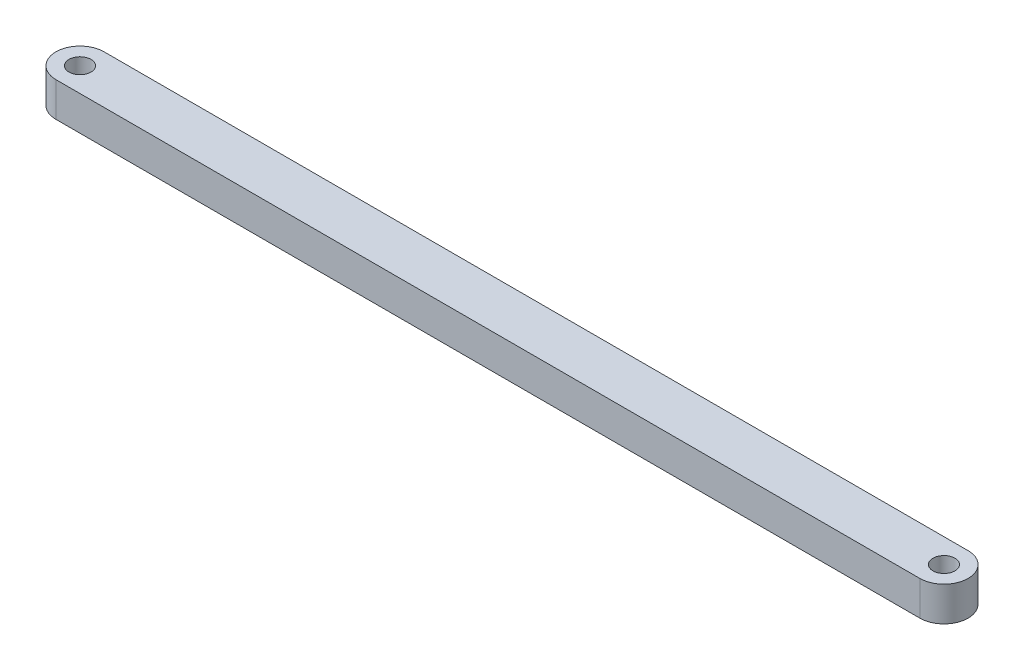
ISO-10303-21;
HEADER;
FILE_DESCRIPTION(('STEP AP214'),'2;1');
FILE_NAME('part.step','',(''),(''),'','','');
FILE_SCHEMA(('AUTOMOTIVE_DESIGN { 1 0 10303 214 1 1 1 1 }'));
ENDSEC;
DATA;
#1=APPLICATION_CONTEXT('core data for automotive mechanical design processes');
#2=APPLICATION_PROTOCOL_DEFINITION('international standard','automotive_design',2000,#1);
#3=PRODUCT_CONTEXT('',#1,'mechanical');
#4=PRODUCT('Part','Part','',(#3));
#5=PRODUCT_RELATED_PRODUCT_CATEGORY('part','',(#4));
#6=PRODUCT_DEFINITION_FORMATION('','',#4);
#7=PRODUCT_DEFINITION_CONTEXT('part definition',#1,'design');
#8=PRODUCT_DEFINITION('design','',#6,#7);
#9=PRODUCT_DEFINITION_SHAPE('','',#8);
#10=(LENGTH_UNIT() NAMED_UNIT(*) SI_UNIT(.MILLI.,.METRE.));
#11=(NAMED_UNIT(*) PLANE_ANGLE_UNIT() SI_UNIT($,.RADIAN.));
#12=(NAMED_UNIT(*) SI_UNIT($,.STERADIAN.) SOLID_ANGLE_UNIT());
#13=UNCERTAINTY_MEASURE_WITH_UNIT(LENGTH_MEASURE(1.E-05),#10,'distance_accuracy_value','');
#14=(GEOMETRIC_REPRESENTATION_CONTEXT(3) GLOBAL_UNCERTAINTY_ASSIGNED_CONTEXT((#13)) GLOBAL_UNIT_ASSIGNED_CONTEXT((#10,
#11,#12)) REPRESENTATION_CONTEXT('',''));
#15=CARTESIAN_POINT('',(0.,0.,0.));
#16=DIRECTION('',(0.,0.,1.));
#17=DIRECTION('',(1.,0.,0.));
#18=AXIS2_PLACEMENT_3D('',#15,#16,#17);
#19=CARTESIAN_POINT('',(0.,5.,0.));
#20=DIRECTION('',(0.,1.,0.));
#21=DIRECTION('',(0.,0.,1.));
#22=AXIS2_PLACEMENT_3D('',#19,#20,#21);
#23=PLANE('',#22);
#24=CARTESIAN_POINT('',(0.,5.,0.));
#25=DIRECTION('',(0.,1.,0.));
#26=DIRECTION('',(0.,0.,1.));
#27=AXIS2_PLACEMENT_3D('',#24,#25,#26);
#28=CIRCLE('',#27,1.6);
#29=CARTESIAN_POINT('',(0.,5.,1.6));
#30=VERTEX_POINT('',#29);
#31=EDGE_CURVE('E118',#30,#30,#28,.T.);
#32=ORIENTED_EDGE('',*,*,#31,.F.);
#33=EDGE_LOOP('',(#32));
#34=FACE_BOUND('',#33,.T.);
#35=CARTESIAN_POINT('',(0.,5.,0.));
#36=DIRECTION('',(0.,1.,0.));
#37=DIRECTION('',(0.,0.,1.));
#38=AXIS2_PLACEMENT_3D('',#35,#36,#37);
#39=CIRCLE('',#38,3.5);
#40=CARTESIAN_POINT('',(0.,5.,-3.5));
#41=VERTEX_POINT('',#40);
#42=CARTESIAN_POINT('',(0.,5.,3.5));
#43=VERTEX_POINT('',#42);
#44=EDGE_CURVE('E98',#41,#43,#39,.T.);
#45=ORIENTED_EDGE('',*,*,#44,.T.);
#46=DIRECTION('',(1.,0.,0.));
#47=VECTOR('',#46,1.);
#48=CARTESIAN_POINT('',(0.,5.,3.5));
#49=LINE('',#48,#47);
#50=CARTESIAN_POINT('',(125.5,5.,3.5));
#51=VERTEX_POINT('',#50);
#52=EDGE_CURVE('E93',#43,#51,#49,.T.);
#53=ORIENTED_EDGE('',*,*,#52,.T.);
#54=CARTESIAN_POINT('',(125.5,5.,0.));
#55=DIRECTION('',(0.,1.,0.));
#56=DIRECTION('',(0.,0.,1.));
#57=AXIS2_PLACEMENT_3D('',#54,#55,#56);
#58=CIRCLE('',#57,3.5);
#59=CARTESIAN_POINT('',(125.5,5.,-3.5));
#60=VERTEX_POINT('',#59);
#61=EDGE_CURVE('E96',#51,#60,#58,.T.);
#62=ORIENTED_EDGE('',*,*,#61,.T.);
#63=DIRECTION('',(-1.,0.,0.));
#64=VECTOR('',#63,1.);
#65=CARTESIAN_POINT('',(0.,5.,-3.5));
#66=LINE('',#65,#64);
#67=EDGE_CURVE('E63',#60,#41,#66,.T.);
#68=ORIENTED_EDGE('',*,*,#67,.T.);
#69=EDGE_LOOP('',(#45,#53,#62,#68));
#70=FACE_BOUND('',#69,.T.);
#71=CARTESIAN_POINT('',(125.5,5.,0.));
#72=DIRECTION('',(0.,1.,0.));
#73=DIRECTION('',(0.,0.,1.));
#74=AXIS2_PLACEMENT_3D('',#71,#72,#73);
#75=CIRCLE('',#74,1.59999999999999);
#76=CARTESIAN_POINT('',(125.5,5.,1.59999999999999));
#77=VERTEX_POINT('',#76);
#78=EDGE_CURVE('E140',#77,#77,#75,.T.);
#79=ORIENTED_EDGE('',*,*,#78,.F.);
#80=EDGE_LOOP('',(#79));
#81=FACE_BOUND('',#80,.T.);
#82=ADVANCED_FACE('F45',(#34,#70,#81),#23,.T.);
#83=CARTESIAN_POINT('',(0.,0.,0.));
#84=DIRECTION('',(0.,1.,0.));
#85=DIRECTION('',(0.,0.,1.));
#86=AXIS2_PLACEMENT_3D('',#83,#84,#85);
#87=PLANE('',#86);
#88=CARTESIAN_POINT('',(0.,0.,0.));
#89=DIRECTION('',(0.,1.,0.));
#90=DIRECTION('',(0.,0.,1.));
#91=AXIS2_PLACEMENT_3D('',#88,#89,#90);
#92=CIRCLE('',#91,3.5);
#93=CARTESIAN_POINT('',(0.,0.,-3.5));
#94=VERTEX_POINT('',#93);
#95=CARTESIAN_POINT('',(0.,0.,3.5));
#96=VERTEX_POINT('',#95);
#97=EDGE_CURVE('E114',#94,#96,#92,.T.);
#98=ORIENTED_EDGE('',*,*,#97,.F.);
#99=DIRECTION('',(-1.,0.,0.));
#100=VECTOR('',#99,1.);
#101=CARTESIAN_POINT('',(0.,0.,-3.5));
#102=LINE('',#101,#100);
#103=CARTESIAN_POINT('',(125.5,0.,-3.5));
#104=VERTEX_POINT('',#103);
#105=EDGE_CURVE('E86',#104,#94,#102,.T.);
#106=ORIENTED_EDGE('',*,*,#105,.F.);
#107=CARTESIAN_POINT('',(125.5,0.,0.));
#108=DIRECTION('',(0.,1.,0.));
#109=DIRECTION('',(0.,0.,1.));
#110=AXIS2_PLACEMENT_3D('',#107,#108,#109);
#111=CIRCLE('',#110,3.5);
#112=CARTESIAN_POINT('',(125.5,0.,3.5));
#113=VERTEX_POINT('',#112);
#114=EDGE_CURVE('E80',#113,#104,#111,.T.);
#115=ORIENTED_EDGE('',*,*,#114,.F.);
#116=DIRECTION('',(1.,0.,0.));
#117=VECTOR('',#116,1.);
#118=CARTESIAN_POINT('',(0.,0.,3.5));
#119=LINE('',#118,#117);
#120=EDGE_CURVE('E103',#96,#113,#119,.T.);
#121=ORIENTED_EDGE('',*,*,#120,.F.);
#122=EDGE_LOOP('',(#98,#106,#115,#121));
#123=FACE_BOUND('',#122,.T.);
#124=CARTESIAN_POINT('',(0.,0.,0.));
#125=DIRECTION('',(0.,1.,0.));
#126=DIRECTION('',(0.,0.,1.));
#127=AXIS2_PLACEMENT_3D('',#124,#125,#126);
#128=CIRCLE('',#127,1.6);
#129=CARTESIAN_POINT('',(0.,0.,1.6));
#130=VERTEX_POINT('',#129);
#131=EDGE_CURVE('E136',#130,#130,#128,.T.);
#132=ORIENTED_EDGE('',*,*,#131,.T.);
#133=EDGE_LOOP('',(#132));
#134=FACE_BOUND('',#133,.T.);
#135=CARTESIAN_POINT('',(125.5,0.,0.));
#136=DIRECTION('',(0.,1.,0.));
#137=DIRECTION('',(0.,0.,1.));
#138=AXIS2_PLACEMENT_3D('',#135,#136,#137);
#139=CIRCLE('',#138,1.59999999999999);
#140=CARTESIAN_POINT('',(125.5,0.,1.59999999999999));
#141=VERTEX_POINT('',#140);
#142=EDGE_CURVE('E144',#141,#141,#139,.T.);
#143=ORIENTED_EDGE('',*,*,#142,.T.);
#144=EDGE_LOOP('',(#143));
#145=FACE_BOUND('',#144,.T.);
#146=ADVANCED_FACE('F131',(#123,#134,#145),#87,.F.);
#147=CARTESIAN_POINT('',(0.,5.,0.));
#148=DIRECTION('',(0.,-1.,0.));
#149=DIRECTION('',(0.,0.,-1.));
#150=AXIS2_PLACEMENT_3D('',#147,#148,#149);
#151=CYLINDRICAL_SURFACE('',#150,3.5);
#152=ORIENTED_EDGE('',*,*,#97,.T.);
#153=DIRECTION('',(0.,-1.,0.));
#154=VECTOR('',#153,1.);
#155=CARTESIAN_POINT('',(0.,5.,3.5));
#156=LINE('',#155,#154);
#157=EDGE_CURVE('E11',#43,#96,#156,.T.);
#158=ORIENTED_EDGE('',*,*,#157,.F.);
#159=ORIENTED_EDGE('',*,*,#44,.F.);
#160=DIRECTION('',(0.,-1.,0.));
#161=VECTOR('',#160,1.);
#162=CARTESIAN_POINT('',(0.,5.,-3.5));
#163=LINE('',#162,#161);
#164=EDGE_CURVE('E110',#41,#94,#163,.T.);
#165=ORIENTED_EDGE('',*,*,#164,.T.);
#166=EDGE_LOOP('',(#152,#158,#159,#165));
#167=FACE_BOUND('',#166,.T.);
#168=ADVANCED_FACE('F47',(#167),#151,.T.);
#169=CARTESIAN_POINT('',(0.,5.,3.5));
#170=DIRECTION('',(0.,0.,-1.));
#171=DIRECTION('',(-1.,0.,0.));
#172=AXIS2_PLACEMENT_3D('',#169,#170,#171);
#173=PLANE('',#172);
#174=ORIENTED_EDGE('',*,*,#120,.T.);
#175=DIRECTION('',(0.,-1.,0.));
#176=VECTOR('',#175,1.);
#177=CARTESIAN_POINT('',(125.5,5.,3.5));
#178=LINE('',#177,#176);
#179=EDGE_CURVE('E55',#51,#113,#178,.T.);
#180=ORIENTED_EDGE('',*,*,#179,.F.);
#181=ORIENTED_EDGE('',*,*,#52,.F.);
#182=ORIENTED_EDGE('',*,*,#157,.T.);
#183=EDGE_LOOP('',(#174,#180,#181,#182));
#184=FACE_BOUND('',#183,.T.);
#185=ADVANCED_FACE('F102',(#184),#173,.F.);
#186=CARTESIAN_POINT('',(125.5,5.,0.));
#187=DIRECTION('',(0.,-1.,0.));
#188=DIRECTION('',(0.,0.,-1.));
#189=AXIS2_PLACEMENT_3D('',#186,#187,#188);
#190=CYLINDRICAL_SURFACE('',#189,3.5);
#191=ORIENTED_EDGE('',*,*,#114,.T.);
#192=DIRECTION('',(0.,-1.,0.));
#193=VECTOR('',#192,1.);
#194=CARTESIAN_POINT('',(125.5,5.,-3.5));
#195=LINE('',#194,#193);
#196=EDGE_CURVE('E105',#60,#104,#195,.T.);
#197=ORIENTED_EDGE('',*,*,#196,.F.);
#198=ORIENTED_EDGE('',*,*,#61,.F.);
#199=ORIENTED_EDGE('',*,*,#179,.T.);
#200=EDGE_LOOP('',(#191,#197,#198,#199));
#201=FACE_BOUND('',#200,.T.);
#202=ADVANCED_FACE('F106',(#201),#190,.T.);
#203=CARTESIAN_POINT('',(0.,5.,-3.5));
#204=DIRECTION('',(0.,0.,1.));
#205=DIRECTION('',(1.,0.,0.));
#206=AXIS2_PLACEMENT_3D('',#203,#204,#205);
#207=PLANE('',#206);
#208=ORIENTED_EDGE('',*,*,#105,.T.);
#209=ORIENTED_EDGE('',*,*,#164,.F.);
#210=ORIENTED_EDGE('',*,*,#67,.F.);
#211=ORIENTED_EDGE('',*,*,#196,.T.);
#212=EDGE_LOOP('',(#208,#209,#210,#211));
#213=FACE_BOUND('',#212,.T.);
#214=ADVANCED_FACE('F128',(#213),#207,.F.);
#215=CARTESIAN_POINT('',(0.,5.,0.));
#216=DIRECTION('',(0.,-1.,0.));
#217=DIRECTION('',(0.,0.,-1.));
#218=AXIS2_PLACEMENT_3D('',#215,#216,#217);
#219=CYLINDRICAL_SURFACE('',#218,1.6);
#220=ORIENTED_EDGE('',*,*,#31,.T.);
#221=EDGE_LOOP('',(#220));
#222=FACE_BOUND('',#221,.T.);
#223=ORIENTED_EDGE('',*,*,#131,.F.);
#224=EDGE_LOOP('',(#223));
#225=FACE_BOUND('',#224,.T.);
#226=ADVANCED_FACE('F163',(#222,#225),#219,.F.);
#227=CARTESIAN_POINT('',(125.5,5.,0.));
#228=DIRECTION('',(0.,-1.,0.));
#229=DIRECTION('',(0.,0.,-1.));
#230=AXIS2_PLACEMENT_3D('',#227,#228,#229);
#231=CYLINDRICAL_SURFACE('',#230,1.59999999999999);
#232=ORIENTED_EDGE('',*,*,#78,.T.);
#233=EDGE_LOOP('',(#232));
#234=FACE_BOUND('',#233,.T.);
#235=ORIENTED_EDGE('',*,*,#142,.F.);
#236=EDGE_LOOP('',(#235));
#237=FACE_BOUND('',#236,.T.);
#238=ADVANCED_FACE('F152',(#234,#237),#231,.F.);
#239=CLOSED_SHELL('',(#82,#146,#168,#185,#202,#214,#226,#238));
#240=MANIFOLD_SOLID_BREP('B2',#239);
#241=ADVANCED_BREP_SHAPE_REPRESENTATION('',(#18,#240),#14);
#242=SHAPE_DEFINITION_REPRESENTATION(#9,#241);
ENDSEC;
END-ISO-10303-21;
